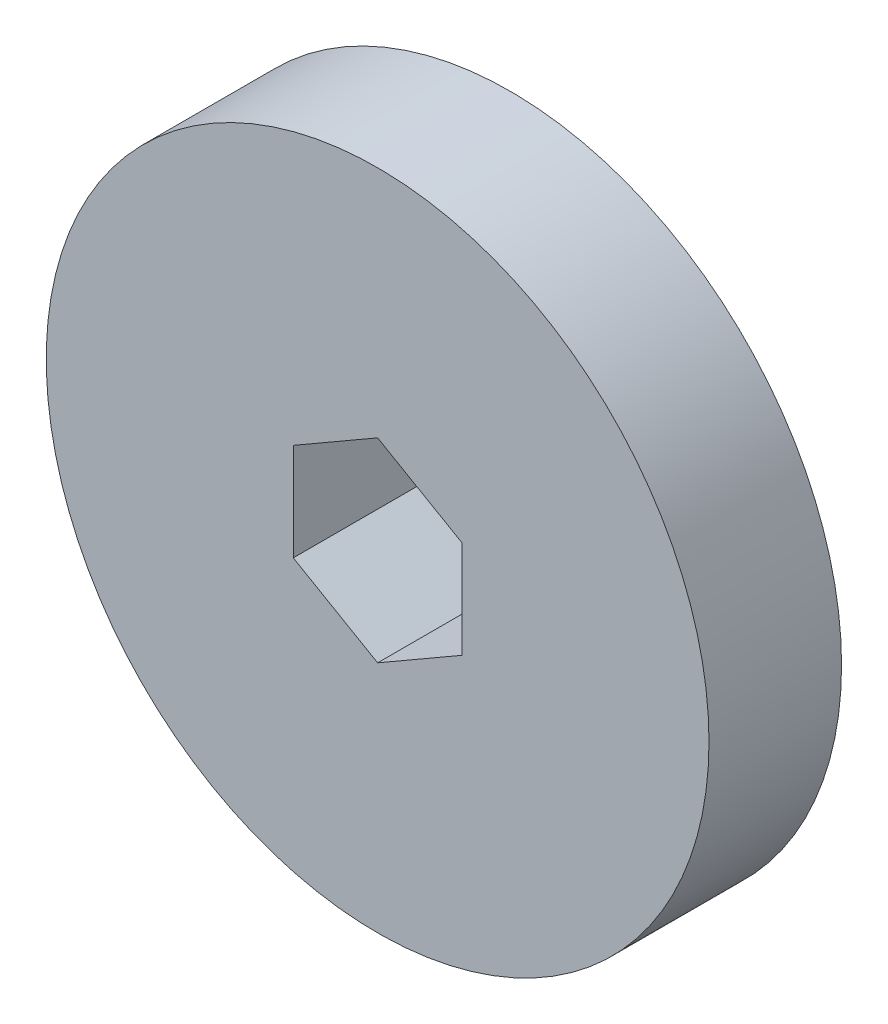
ISO-10303-21;
HEADER;
FILE_DESCRIPTION(('STEP AP214'),'2;1');
FILE_NAME('part.step','',(''),(''),'','','');
FILE_SCHEMA(('AUTOMOTIVE_DESIGN { 1 0 10303 214 1 1 1 1 }'));
ENDSEC;
DATA;
#1=APPLICATION_CONTEXT('core data for automotive mechanical design processes');
#2=APPLICATION_PROTOCOL_DEFINITION('international standard','automotive_design',2000,#1);
#3=PRODUCT_CONTEXT('',#1,'mechanical');
#4=PRODUCT('Part','Part','',(#3));
#5=PRODUCT_RELATED_PRODUCT_CATEGORY('part','',(#4));
#6=PRODUCT_DEFINITION_FORMATION('','',#4);
#7=PRODUCT_DEFINITION_CONTEXT('part definition',#1,'design');
#8=PRODUCT_DEFINITION('design','',#6,#7);
#9=PRODUCT_DEFINITION_SHAPE('','',#8);
#10=(LENGTH_UNIT() NAMED_UNIT(*) SI_UNIT(.MILLI.,.METRE.));
#11=(NAMED_UNIT(*) PLANE_ANGLE_UNIT() SI_UNIT($,.RADIAN.));
#12=(NAMED_UNIT(*) SI_UNIT($,.STERADIAN.) SOLID_ANGLE_UNIT());
#13=UNCERTAINTY_MEASURE_WITH_UNIT(LENGTH_MEASURE(1.E-05),#10,'distance_accuracy_value','');
#14=(GEOMETRIC_REPRESENTATION_CONTEXT(3) GLOBAL_UNCERTAINTY_ASSIGNED_CONTEXT((#13)) GLOBAL_UNIT_ASSIGNED_CONTEXT((#10,
#11,#12)) REPRESENTATION_CONTEXT('',''));
#15=CARTESIAN_POINT('',(0.,0.,0.));
#16=DIRECTION('',(0.,0.,1.));
#17=DIRECTION('',(1.,0.,0.));
#18=AXIS2_PLACEMENT_3D('',#15,#16,#17);
#19=CARTESIAN_POINT('',(0.,0.,10.));
#20=DIRECTION('',(0.,0.,-1.));
#21=DIRECTION('',(-1.,0.,0.));
#22=AXIS2_PLACEMENT_3D('',#19,#20,#21);
#23=CYLINDRICAL_SURFACE('',#22,25.);
#24=CARTESIAN_POINT('',(0.,0.,10.));
#25=DIRECTION('',(0.,0.,1.));
#26=DIRECTION('',(1.,0.,0.));
#27=AXIS2_PLACEMENT_3D('',#24,#25,#26);
#28=CIRCLE('',#27,25.);
#29=CARTESIAN_POINT('',(25.,0.,10.));
#30=VERTEX_POINT('',#29);
#31=EDGE_CURVE('E11',#30,#30,#28,.T.);
#32=ORIENTED_EDGE('',*,*,#31,.F.);
#33=EDGE_LOOP('',(#32));
#34=FACE_BOUND('',#33,.T.);
#35=CARTESIAN_POINT('',(0.,0.,0.));
#36=DIRECTION('',(0.,0.,1.));
#37=DIRECTION('',(1.,0.,0.));
#38=AXIS2_PLACEMENT_3D('',#35,#36,#37);
#39=CIRCLE('',#38,25.);
#40=CARTESIAN_POINT('',(25.,0.,0.));
#41=VERTEX_POINT('',#40);
#42=EDGE_CURVE('E45',#41,#41,#39,.T.);
#43=ORIENTED_EDGE('',*,*,#42,.T.);
#44=EDGE_LOOP('',(#43));
#45=FACE_BOUND('',#44,.T.);
#46=ADVANCED_FACE('F39',(#34,#45),#23,.T.);
#47=CARTESIAN_POINT('',(0.,0.,10.));
#48=DIRECTION('',(0.,0.,1.));
#49=DIRECTION('',(1.,0.,0.));
#50=AXIS2_PLACEMENT_3D('',#47,#48,#49);
#51=PLANE('',#50);
#52=DIRECTION('',(-0.866025403784439,0.5,0.));
#53=VECTOR('',#52,1.);
#54=CARTESIAN_POINT('',(6.365,3.67483446339197,10.));
#55=LINE('',#54,#53);
#56=CARTESIAN_POINT('',(6.365,3.67483446339197,10.));
#57=VERTEX_POINT('',#56);
#58=CARTESIAN_POINT('',(0.,7.34966892678394,10.));
#59=VERTEX_POINT('',#58);
#60=EDGE_CURVE('E52',#57,#59,#55,.T.);
#61=ORIENTED_EDGE('',*,*,#60,.F.);
#62=DIRECTION('',(0.,1.,0.));
#63=VECTOR('',#62,1.);
#64=CARTESIAN_POINT('',(6.365,-3.67483446339197,10.));
#65=LINE('',#64,#63);
#66=CARTESIAN_POINT('',(6.365,-3.67483446339197,10.));
#67=VERTEX_POINT('',#66);
#68=EDGE_CURVE('E109',#67,#57,#65,.T.);
#69=ORIENTED_EDGE('',*,*,#68,.F.);
#70=DIRECTION('',(0.866025403784439,0.5,0.));
#71=VECTOR('',#70,1.);
#72=CARTESIAN_POINT('',(0.,-7.34966892678394,10.));
#73=LINE('',#72,#71);
#74=CARTESIAN_POINT('',(0.,-7.34966892678394,10.));
#75=VERTEX_POINT('',#74);
#76=EDGE_CURVE('E114',#75,#67,#73,.T.);
#77=ORIENTED_EDGE('',*,*,#76,.F.);
#78=DIRECTION('',(0.866025403784438,-0.5,0.));
#79=VECTOR('',#78,1.);
#80=CARTESIAN_POINT('',(-6.36500000000001,-3.67483446339197,10.));
#81=LINE('',#80,#79);
#82=CARTESIAN_POINT('',(-6.36500000000001,-3.67483446339197,10.));
#83=VERTEX_POINT('',#82);
#84=EDGE_CURVE('E129',#83,#75,#81,.T.);
#85=ORIENTED_EDGE('',*,*,#84,.F.);
#86=DIRECTION('',(0.,-1.,0.));
#87=VECTOR('',#86,1.);
#88=CARTESIAN_POINT('',(-6.365,3.67483446339197,10.));
#89=LINE('',#88,#87);
#90=CARTESIAN_POINT('',(-6.365,3.67483446339197,10.));
#91=VERTEX_POINT('',#90);
#92=EDGE_CURVE('E127',#91,#83,#89,.T.);
#93=ORIENTED_EDGE('',*,*,#92,.F.);
#94=DIRECTION('',(-0.866025403784439,-0.5,0.));
#95=VECTOR('',#94,1.);
#96=CARTESIAN_POINT('',(0.,7.34966892678394,10.));
#97=LINE('',#96,#95);
#98=EDGE_CURVE('E122',#59,#91,#97,.T.);
#99=ORIENTED_EDGE('',*,*,#98,.F.);
#100=EDGE_LOOP('',(#61,#69,#77,#85,#93,#99));
#101=FACE_BOUND('',#100,.T.);
#102=ORIENTED_EDGE('',*,*,#31,.T.);
#103=EDGE_LOOP('',(#102));
#104=FACE_BOUND('',#103,.T.);
#105=ADVANCED_FACE('F148',(#101,#104),#51,.T.);
#106=CARTESIAN_POINT('',(0.,0.,0.));
#107=DIRECTION('',(0.,0.,1.));
#108=DIRECTION('',(1.,0.,0.));
#109=AXIS2_PLACEMENT_3D('',#106,#107,#108);
#110=PLANE('',#109);
#111=DIRECTION('',(0.,1.,0.));
#112=VECTOR('',#111,1.);
#113=CARTESIAN_POINT('',(6.365,-3.67483446339197,0.));
#114=LINE('',#113,#112);
#115=CARTESIAN_POINT('',(6.365,-3.67483446339197,0.));
#116=VERTEX_POINT('',#115);
#117=CARTESIAN_POINT('',(6.365,3.67483446339197,0.));
#118=VERTEX_POINT('',#117);
#119=EDGE_CURVE('E97',#116,#118,#114,.T.);
#120=ORIENTED_EDGE('',*,*,#119,.T.);
#121=DIRECTION('',(-0.866025403784439,0.5,0.));
#122=VECTOR('',#121,1.);
#123=CARTESIAN_POINT('',(6.365,3.67483446339197,0.));
#124=LINE('',#123,#122);
#125=CARTESIAN_POINT('',(0.,7.34966892678394,0.));
#126=VERTEX_POINT('',#125);
#127=EDGE_CURVE('E91',#118,#126,#124,.T.);
#128=ORIENTED_EDGE('',*,*,#127,.T.);
#129=DIRECTION('',(-0.866025403784439,-0.5,0.));
#130=VECTOR('',#129,1.);
#131=CARTESIAN_POINT('',(0.,7.34966892678394,0.));
#132=LINE('',#131,#130);
#133=CARTESIAN_POINT('',(-6.365,3.67483446339197,0.));
#134=VERTEX_POINT('',#133);
#135=EDGE_CURVE('E105',#126,#134,#132,.T.);
#136=ORIENTED_EDGE('',*,*,#135,.T.);
#137=DIRECTION('',(0.,-1.,0.));
#138=VECTOR('',#137,1.);
#139=CARTESIAN_POINT('',(-6.365,3.67483446339197,0.));
#140=LINE('',#139,#138);
#141=CARTESIAN_POINT('',(-6.36500000000001,-3.67483446339197,0.));
#142=VERTEX_POINT('',#141);
#143=EDGE_CURVE('E64',#134,#142,#140,.T.);
#144=ORIENTED_EDGE('',*,*,#143,.T.);
#145=DIRECTION('',(0.866025403784438,-0.5,0.));
#146=VECTOR('',#145,1.);
#147=CARTESIAN_POINT('',(-6.36500000000001,-3.67483446339197,0.));
#148=LINE('',#147,#146);
#149=CARTESIAN_POINT('',(0.,-7.34966892678394,0.));
#150=VERTEX_POINT('',#149);
#151=EDGE_CURVE('E116',#142,#150,#148,.T.);
#152=ORIENTED_EDGE('',*,*,#151,.T.);
#153=DIRECTION('',(0.866025403784439,0.5,0.));
#154=VECTOR('',#153,1.);
#155=CARTESIAN_POINT('',(0.,-7.34966892678394,0.));
#156=LINE('',#155,#154);
#157=EDGE_CURVE('E117',#150,#116,#156,.T.);
#158=ORIENTED_EDGE('',*,*,#157,.T.);
#159=EDGE_LOOP('',(#120,#128,#136,#144,#152,#158));
#160=FACE_BOUND('',#159,.T.);
#161=ORIENTED_EDGE('',*,*,#42,.F.);
#162=EDGE_LOOP('',(#161));
#163=FACE_BOUND('',#162,.T.);
#164=ADVANCED_FACE('F106',(#160,#163),#110,.F.);
#165=CARTESIAN_POINT('',(6.365,3.67483446339197,0.));
#166=DIRECTION('',(0.5,0.866025403784439,0.));
#167=DIRECTION('',(-0.866025403784439,0.5,0.));
#168=AXIS2_PLACEMENT_3D('',#165,#166,#167);
#169=PLANE('',#168);
#170=ORIENTED_EDGE('',*,*,#60,.T.);
#171=DIRECTION('',(0.,0.,1.));
#172=VECTOR('',#171,1.);
#173=CARTESIAN_POINT('',(0.,7.34966892678394,0.));
#174=LINE('',#173,#172);
#175=EDGE_CURVE('E90',#126,#59,#174,.T.);
#176=ORIENTED_EDGE('',*,*,#175,.F.);
#177=ORIENTED_EDGE('',*,*,#127,.F.);
#178=DIRECTION('',(0.,0.,1.));
#179=VECTOR('',#178,1.);
#180=CARTESIAN_POINT('',(6.365,3.67483446339197,0.));
#181=LINE('',#180,#179);
#182=EDGE_CURVE('E133',#118,#57,#181,.T.);
#183=ORIENTED_EDGE('',*,*,#182,.T.);
#184=EDGE_LOOP('',(#170,#176,#177,#183));
#185=FACE_BOUND('',#184,.T.);
#186=ADVANCED_FACE('F93',(#185),#169,.F.);
#187=CARTESIAN_POINT('',(6.365,-3.67483446339197,0.));
#188=DIRECTION('',(1.,0.,0.));
#189=DIRECTION('',(0.,1.,0.));
#190=AXIS2_PLACEMENT_3D('',#187,#188,#189);
#191=PLANE('',#190);
#192=ORIENTED_EDGE('',*,*,#68,.T.);
#193=ORIENTED_EDGE('',*,*,#182,.F.);
#194=ORIENTED_EDGE('',*,*,#119,.F.);
#195=DIRECTION('',(0.,0.,1.));
#196=VECTOR('',#195,1.);
#197=CARTESIAN_POINT('',(6.365,-3.67483446339197,0.));
#198=LINE('',#197,#196);
#199=EDGE_CURVE('E138',#116,#67,#198,.T.);
#200=ORIENTED_EDGE('',*,*,#199,.T.);
#201=EDGE_LOOP('',(#192,#193,#194,#200));
#202=FACE_BOUND('',#201,.T.);
#203=ADVANCED_FACE('F160',(#202),#191,.F.);
#204=CARTESIAN_POINT('',(0.,-7.34966892678394,0.));
#205=DIRECTION('',(0.5,-0.866025403784439,0.));
#206=DIRECTION('',(0.866025403784439,0.5,0.));
#207=AXIS2_PLACEMENT_3D('',#204,#205,#206);
#208=PLANE('',#207);
#209=ORIENTED_EDGE('',*,*,#76,.T.);
#210=ORIENTED_EDGE('',*,*,#199,.F.);
#211=ORIENTED_EDGE('',*,*,#157,.F.);
#212=DIRECTION('',(0.,0.,1.));
#213=VECTOR('',#212,1.);
#214=CARTESIAN_POINT('',(0.,-7.34966892678394,0.));
#215=LINE('',#214,#213);
#216=EDGE_CURVE('E136',#150,#75,#215,.T.);
#217=ORIENTED_EDGE('',*,*,#216,.T.);
#218=EDGE_LOOP('',(#209,#210,#211,#217));
#219=FACE_BOUND('',#218,.T.);
#220=ADVANCED_FACE('F154',(#219),#208,.F.);
#221=CARTESIAN_POINT('',(-6.36500000000001,-3.67483446339197,0.));
#222=DIRECTION('',(-0.5,-0.866025403784438,0.));
#223=DIRECTION('',(0.866025403784439,-0.5,0.));
#224=AXIS2_PLACEMENT_3D('',#221,#222,#223);
#225=PLANE('',#224);
#226=ORIENTED_EDGE('',*,*,#84,.T.);
#227=ORIENTED_EDGE('',*,*,#216,.F.);
#228=ORIENTED_EDGE('',*,*,#151,.F.);
#229=DIRECTION('',(0.,0.,1.));
#230=VECTOR('',#229,1.);
#231=CARTESIAN_POINT('',(-6.36500000000001,-3.67483446339197,0.));
#232=LINE('',#231,#230);
#233=EDGE_CURVE('E139',#142,#83,#232,.T.);
#234=ORIENTED_EDGE('',*,*,#233,.T.);
#235=EDGE_LOOP('',(#226,#227,#228,#234));
#236=FACE_BOUND('',#235,.T.);
#237=ADVANCED_FACE('F151',(#236),#225,.F.);
#238=CARTESIAN_POINT('',(-6.365,3.67483446339197,0.));
#239=DIRECTION('',(-1.,0.,0.));
#240=DIRECTION('',(0.,-1.,0.));
#241=AXIS2_PLACEMENT_3D('',#238,#239,#240);
#242=PLANE('',#241);
#243=ORIENTED_EDGE('',*,*,#92,.T.);
#244=ORIENTED_EDGE('',*,*,#233,.F.);
#245=ORIENTED_EDGE('',*,*,#143,.F.);
#246=DIRECTION('',(0.,0.,1.));
#247=VECTOR('',#246,1.);
#248=CARTESIAN_POINT('',(-6.365,3.67483446339197,0.));
#249=LINE('',#248,#247);
#250=EDGE_CURVE('E98',#134,#91,#249,.T.);
#251=ORIENTED_EDGE('',*,*,#250,.T.);
#252=EDGE_LOOP('',(#243,#244,#245,#251));
#253=FACE_BOUND('',#252,.T.);
#254=ADVANCED_FACE('F142',(#253),#242,.F.);
#255=CARTESIAN_POINT('',(0.,7.34966892678394,0.));
#256=DIRECTION('',(-0.5,0.866025403784439,0.));
#257=DIRECTION('',(-0.866025403784439,-0.5,0.));
#258=AXIS2_PLACEMENT_3D('',#255,#256,#257);
#259=PLANE('',#258);
#260=ORIENTED_EDGE('',*,*,#98,.T.);
#261=ORIENTED_EDGE('',*,*,#250,.F.);
#262=ORIENTED_EDGE('',*,*,#135,.F.);
#263=ORIENTED_EDGE('',*,*,#175,.T.);
#264=EDGE_LOOP('',(#260,#261,#262,#263));
#265=FACE_BOUND('',#264,.T.);
#266=ADVANCED_FACE('F103',(#265),#259,.F.);
#267=CLOSED_SHELL('',(#46,#105,#164,#186,#203,#220,#237,#254,#266));
#268=MANIFOLD_SOLID_BREP('B2',#267);
#269=ADVANCED_BREP_SHAPE_REPRESENTATION('',(#18,#268),#14);
#270=SHAPE_DEFINITION_REPRESENTATION(#9,#269);
ENDSEC;
END-ISO-10303-21;
